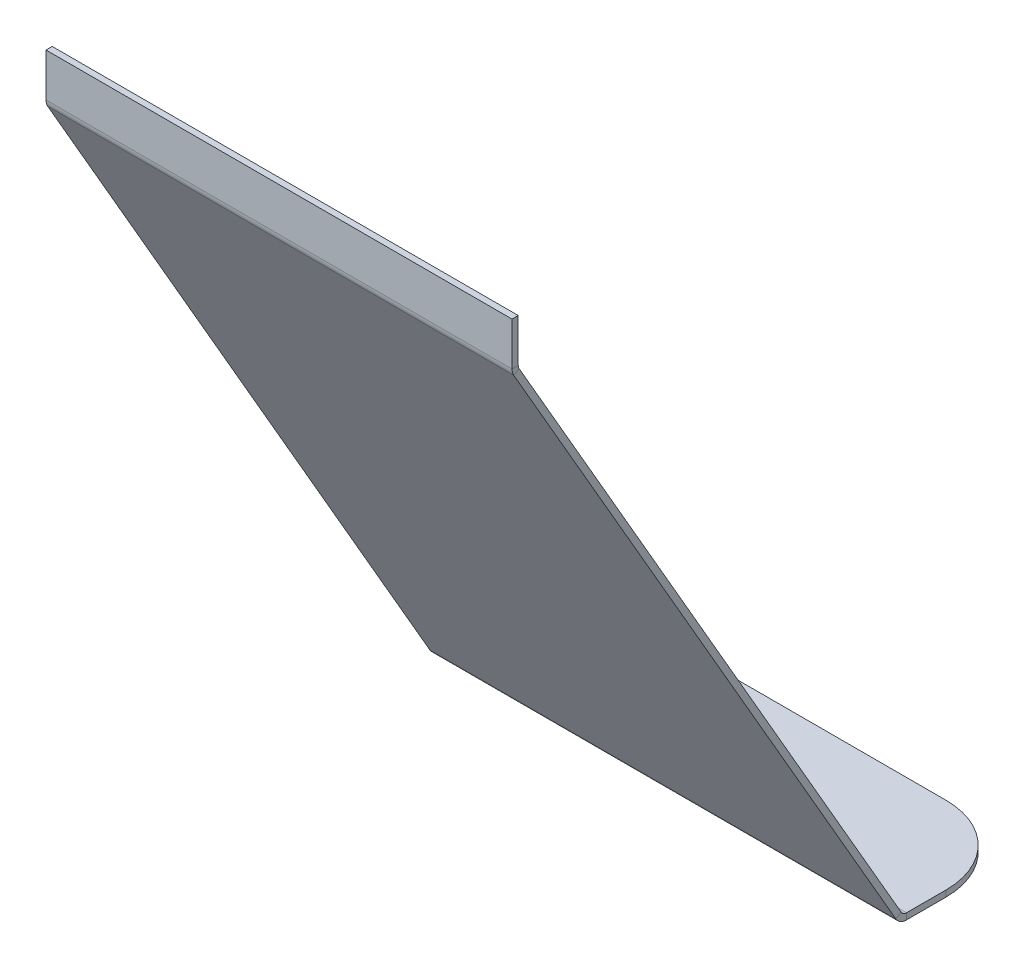
ISO-10303-21;
HEADER;
FILE_DESCRIPTION(('STEP AP214'),'2;1');
FILE_NAME('part.step','',(''),(''),'','','');
FILE_SCHEMA(('AUTOMOTIVE_DESIGN { 1 0 10303 214 1 1 1 1 }'));
ENDSEC;
DATA;
#1=APPLICATION_CONTEXT('core data for automotive mechanical design processes');
#2=APPLICATION_PROTOCOL_DEFINITION('international standard','automotive_design',2000,#1);
#3=PRODUCT_CONTEXT('',#1,'mechanical');
#4=PRODUCT('Part','Part','',(#3));
#5=PRODUCT_RELATED_PRODUCT_CATEGORY('part','',(#4));
#6=PRODUCT_DEFINITION_FORMATION('','',#4);
#7=PRODUCT_DEFINITION_CONTEXT('part definition',#1,'design');
#8=PRODUCT_DEFINITION('design','',#6,#7);
#9=PRODUCT_DEFINITION_SHAPE('','',#8);
#10=(LENGTH_UNIT() NAMED_UNIT(*) SI_UNIT(.MILLI.,.METRE.));
#11=(NAMED_UNIT(*) PLANE_ANGLE_UNIT() SI_UNIT($,.RADIAN.));
#12=(NAMED_UNIT(*) SI_UNIT($,.STERADIAN.) SOLID_ANGLE_UNIT());
#13=UNCERTAINTY_MEASURE_WITH_UNIT(LENGTH_MEASURE(1.E-05),#10,'distance_accuracy_value','');
#14=(GEOMETRIC_REPRESENTATION_CONTEXT(3) GLOBAL_UNCERTAINTY_ASSIGNED_CONTEXT((#13)) GLOBAL_UNIT_ASSIGNED_CONTEXT((#10,
#11,#12)) REPRESENTATION_CONTEXT('',''));
#15=CARTESIAN_POINT('',(0.,0.,0.));
#16=DIRECTION('',(0.,0.,1.));
#17=DIRECTION('',(1.,0.,0.));
#18=AXIS2_PLACEMENT_3D('',#15,#16,#17);
#19=CARTESIAN_POINT('',(30.,43.401,24.8266389254232));
#20=DIRECTION('',(0.,-0.500000000000001,0.866025403784438));
#21=DIRECTION('',(0.,-0.866025403784438,-0.500000000000001));
#22=AXIS2_PLACEMENT_3D('',#19,#20,#21);
#23=PLANE('',#22);
#24=DIRECTION('',(1.,0.,0.));
#25=VECTOR('',#24,1.);
#26=CARTESIAN_POINT('',(30.,43.3081796769724,24.773049086937));
#27=LINE('',#26,#25);
#28=CARTESIAN_POINT('',(30.,43.3081796769724,24.773049086937));
#29=VERTEX_POINT('',#28);
#30=CARTESIAN_POINT('',(0.,43.3081796769724,24.773049086937));
#31=VERTEX_POINT('',#30);
#32=EDGE_CURVE('E247',#29,#31,#27,.F.);
#33=ORIENTED_EDGE('',*,*,#32,.F.);
#34=DIRECTION('',(0.,0.866025403784438,0.500000000000001));
#35=VECTOR('',#34,1.);
#36=CARTESIAN_POINT('',(30.,43.401,24.8266389254232));
#37=LINE('',#36,#35);
#38=CARTESIAN_POINT('',(30.,0.699999999999992,0.173205080756899));
#39=VERTEX_POINT('',#38);
#40=EDGE_CURVE('E327',#39,#29,#37,.T.);
#41=ORIENTED_EDGE('',*,*,#40,.F.);
#42=DIRECTION('',(-1.,0.,0.));
#43=VECTOR('',#42,1.);
#44=CARTESIAN_POINT('',(0.,0.699999999999992,0.173205080756899));
#45=LINE('',#44,#43);
#46=CARTESIAN_POINT('',(0.,0.699999999999992,0.173205080756899));
#47=VERTEX_POINT('',#46);
#48=EDGE_CURVE('E309',#47,#39,#45,.F.);
#49=ORIENTED_EDGE('',*,*,#48,.F.);
#50=DIRECTION('',(0.,0.866025403784438,0.500000000000001));
#51=VECTOR('',#50,1.);
#52=CARTESIAN_POINT('',(0.,43.401,24.8266389254232));
#53=LINE('',#52,#51);
#54=EDGE_CURVE('E323',#47,#31,#53,.T.);
#55=ORIENTED_EDGE('',*,*,#54,.T.);
#56=EDGE_LOOP('',(#33,#41,#49,#55));
#57=FACE_BOUND('',#56,.T.);
#58=ADVANCED_FACE('F70',(#57),#23,.F.);
#59=CARTESIAN_POINT('',(30.,43.201,25.173049086937));
#60=DIRECTION('',(0.,-0.500000000000001,0.866025403784438));
#61=DIRECTION('',(0.,-0.866025403784438,-0.500000000000001));
#62=AXIS2_PLACEMENT_3D('',#59,#60,#61);
#63=PLANE('',#62);
#64=DIRECTION('',(0.,-0.866025403784438,-0.500000000000001));
#65=VECTOR('',#64,1.);
#66=CARTESIAN_POINT('',(30.,43.201,25.173049086937));
#67=LINE('',#66,#65);
#68=CARTESIAN_POINT('',(30.,0.49999999999998,0.519615242270663));
#69=VERTEX_POINT('',#68);
#70=CARTESIAN_POINT('',(30.,43.1081796769724,25.1194592484507));
#71=VERTEX_POINT('',#70);
#72=EDGE_CURVE('E328',#69,#71,#67,.F.);
#73=ORIENTED_EDGE('',*,*,#72,.T.);
#74=DIRECTION('',(1.,0.,0.));
#75=VECTOR('',#74,1.);
#76=CARTESIAN_POINT('',(30.,43.1081796769724,25.1194592484507));
#77=LINE('',#76,#75);
#78=CARTESIAN_POINT('',(0.,43.1081796769724,25.1194592484507));
#79=VERTEX_POINT('',#78);
#80=EDGE_CURVE('E180',#71,#79,#77,.F.);
#81=ORIENTED_EDGE('',*,*,#80,.T.);
#82=DIRECTION('',(0.,-0.866025403784438,-0.500000000000001));
#83=VECTOR('',#82,1.);
#84=CARTESIAN_POINT('',(0.,43.201,25.173049086937));
#85=LINE('',#84,#83);
#86=CARTESIAN_POINT('',(0.,0.499999999999992,0.519615242270674));
#87=VERTEX_POINT('',#86);
#88=EDGE_CURVE('E319',#87,#79,#85,.F.);
#89=ORIENTED_EDGE('',*,*,#88,.F.);
#90=DIRECTION('',(-1.,0.,0.));
#91=VECTOR('',#90,1.);
#92=CARTESIAN_POINT('',(0.,0.499999999999992,0.519615242270674));
#93=LINE('',#92,#91);
#94=EDGE_CURVE('E292',#87,#69,#93,.F.);
#95=ORIENTED_EDGE('',*,*,#94,.T.);
#96=EDGE_LOOP('',(#73,#81,#89,#95));
#97=FACE_BOUND('',#96,.T.);
#98=ADVANCED_FACE('F396',(#97),#63,.T.);
#99=CARTESIAN_POINT('',(30.,43.401,24.8266389254232));
#100=DIRECTION('',(1.,0.,0.));
#101=DIRECTION('',(0.,0.866025403784438,0.500000000000001));
#102=AXIS2_PLACEMENT_3D('',#99,#100,#101);
#103=PLANE('',#102);
#104=ORIENTED_EDGE('',*,*,#40,.T.);
#105=DIRECTION('',(0.,-0.499999999999997,0.866025403784441));
#106=VECTOR('',#105,1.);
#107=CARTESIAN_POINT('',(30.,43.3081796769724,24.773049086937));
#108=LINE('',#107,#106);
#109=EDGE_CURVE('E242',#29,#71,#108,.T.);
#110=ORIENTED_EDGE('',*,*,#109,.T.);
#111=ORIENTED_EDGE('',*,*,#72,.F.);
#112=DIRECTION('',(0.,-0.500000000000001,0.866025403784438));
#113=VECTOR('',#112,1.);
#114=CARTESIAN_POINT('',(30.,0.699999999999992,0.173205080756899));
#115=LINE('',#114,#113);
#116=EDGE_CURVE('E315',#39,#69,#115,.T.);
#117=ORIENTED_EDGE('',*,*,#116,.F.);
#118=EDGE_LOOP('',(#104,#110,#111,#117));
#119=FACE_BOUND('',#118,.T.);
#120=ADVANCED_FACE('F397',(#119),#103,.T.);
#121=CARTESIAN_POINT('',(0.,43.401,24.8266389254232));
#122=DIRECTION('',(1.,0.,0.));
#123=DIRECTION('',(0.,0.866025403784438,0.500000000000001));
#124=AXIS2_PLACEMENT_3D('',#121,#122,#123);
#125=PLANE('',#124);
#126=DIRECTION('',(0.,-0.499999999999997,0.866025403784441));
#127=VECTOR('',#126,1.);
#128=CARTESIAN_POINT('',(0.,43.3081796769724,24.773049086937));
#129=LINE('',#128,#127);
#130=EDGE_CURVE('E252',#31,#79,#129,.T.);
#131=ORIENTED_EDGE('',*,*,#130,.F.);
#132=ORIENTED_EDGE('',*,*,#54,.F.);
#133=DIRECTION('',(0.,-0.500000000000001,0.866025403784438));
#134=VECTOR('',#133,1.);
#135=CARTESIAN_POINT('',(0.,0.699999999999992,0.173205080756899));
#136=LINE('',#135,#134);
#137=EDGE_CURVE('E301',#47,#87,#136,.T.);
#138=ORIENTED_EDGE('',*,*,#137,.T.);
#139=ORIENTED_EDGE('',*,*,#88,.T.);
#140=EDGE_LOOP('',(#131,#132,#138,#139));
#141=FACE_BOUND('',#140,.T.);
#142=ADVANCED_FACE('F408',(#141),#125,.F.);
#143=CARTESIAN_POINT('',(30.,0.899999999999992,-0.173205080756877));
#144=DIRECTION('',(1.,0.,0.));
#145=DIRECTION('',(0.,0.,-1.));
#146=AXIS2_PLACEMENT_3D('',#143,#144,#145);
#147=PLANE('',#146);
#148=DIRECTION('',(0.,1.,0.));
#149=VECTOR('',#148,1.);
#150=CARTESIAN_POINT('',(30.,0.0999999999999924,-0.173205080756874));
#151=LINE('',#150,#149);
#152=CARTESIAN_POINT('',(30.,0.499999999999992,-0.173205080756875));
#153=VERTEX_POINT('',#152);
#154=CARTESIAN_POINT('',(30.,0.0999999999999925,-0.173205080756874));
#155=VERTEX_POINT('',#154);
#156=EDGE_CURVE('E256',#153,#155,#151,.F.);
#157=ORIENTED_EDGE('',*,*,#156,.F.);
#158=CARTESIAN_POINT('',(30.,0.899999999999992,-0.173205080756877));
#159=DIRECTION('',(-1.,0.,0.));
#160=DIRECTION('',(0.,0.,1.));
#161=AXIS2_PLACEMENT_3D('',#158,#159,#160);
#162=CIRCLE('',#161,0.4);
#163=EDGE_CURVE('E305',#39,#153,#162,.F.);
#164=ORIENTED_EDGE('',*,*,#163,.F.);
#165=ORIENTED_EDGE('',*,*,#116,.T.);
#166=CARTESIAN_POINT('',(30.,0.899999999999992,-0.173205080756877));
#167=DIRECTION('',(-1.,0.,0.));
#168=DIRECTION('',(0.,0.,1.));
#169=AXIS2_PLACEMENT_3D('',#166,#167,#168);
#170=CIRCLE('',#169,0.8);
#171=EDGE_CURVE('E296',#69,#155,#170,.F.);
#172=ORIENTED_EDGE('',*,*,#171,.T.);
#173=EDGE_LOOP('',(#157,#164,#165,#172));
#174=FACE_BOUND('',#173,.T.);
#175=ADVANCED_FACE('F388',(#174),#147,.T.);
#176=CARTESIAN_POINT('',(0.,0.899999999999992,-0.173205080756877));
#177=DIRECTION('',(1.,0.,0.));
#178=DIRECTION('',(0.,0.,-1.));
#179=AXIS2_PLACEMENT_3D('',#176,#177,#178);
#180=PLANE('',#179);
#181=CARTESIAN_POINT('',(0.,0.899999999999992,-0.173205080756877));
#182=DIRECTION('',(-1.,0.,0.));
#183=DIRECTION('',(0.,0.,1.));
#184=AXIS2_PLACEMENT_3D('',#181,#182,#183);
#185=CIRCLE('',#184,0.4);
#186=CARTESIAN_POINT('',(0.,0.499999999999992,-0.173205080756875));
#187=VERTEX_POINT('',#186);
#188=EDGE_CURVE('E262',#187,#47,#185,.T.);
#189=ORIENTED_EDGE('',*,*,#188,.F.);
#190=DIRECTION('',(0.,1.,0.));
#191=VECTOR('',#190,1.);
#192=CARTESIAN_POINT('',(0.,0.499999999999992,-0.173205080756875));
#193=LINE('',#192,#191);
#194=CARTESIAN_POINT('',(0.,0.0999999999999924,-0.173205080756873));
#195=VERTEX_POINT('',#194);
#196=EDGE_CURVE('E282',#187,#195,#193,.F.);
#197=ORIENTED_EDGE('',*,*,#196,.T.);
#198=CARTESIAN_POINT('',(0.,0.899999999999992,-0.173205080756877));
#199=DIRECTION('',(-1.,0.,0.));
#200=DIRECTION('',(0.,0.,1.));
#201=AXIS2_PLACEMENT_3D('',#198,#199,#200);
#202=CIRCLE('',#201,0.8);
#203=EDGE_CURVE('E297',#195,#87,#202,.T.);
#204=ORIENTED_EDGE('',*,*,#203,.T.);
#205=ORIENTED_EDGE('',*,*,#137,.F.);
#206=EDGE_LOOP('',(#189,#197,#204,#205));
#207=FACE_BOUND('',#206,.T.);
#208=ADVANCED_FACE('F384',(#207),#180,.F.);
#209=CARTESIAN_POINT('',(0.,0.899999999999992,-0.173205080756877));
#210=DIRECTION('',(-1.,0.,0.));
#211=DIRECTION('',(0.,-1.,0.));
#212=AXIS2_PLACEMENT_3D('',#209,#210,#211);
#213=CYLINDRICAL_SURFACE('',#212,0.8);
#214=ORIENTED_EDGE('',*,*,#94,.F.);
#215=ORIENTED_EDGE('',*,*,#203,.F.);
#216=DIRECTION('',(-1.,0.,0.));
#217=VECTOR('',#216,1.);
#218=CARTESIAN_POINT('',(30.,0.0999999999999924,-0.173205080756874));
#219=LINE('',#218,#217);
#220=EDGE_CURVE('E278',#195,#155,#219,.F.);
#221=ORIENTED_EDGE('',*,*,#220,.T.);
#222=ORIENTED_EDGE('',*,*,#171,.F.);
#223=EDGE_LOOP('',(#214,#215,#221,#222));
#224=FACE_BOUND('',#223,.T.);
#225=ADVANCED_FACE('F386',(#224),#213,.T.);
#226=CARTESIAN_POINT('',(0.,0.899999999999992,-0.173205080756877));
#227=DIRECTION('',(-1.,0.,0.));
#228=DIRECTION('',(0.,-1.,0.));
#229=AXIS2_PLACEMENT_3D('',#226,#227,#228);
#230=CYLINDRICAL_SURFACE('',#229,0.4);
#231=ORIENTED_EDGE('',*,*,#48,.T.);
#232=ORIENTED_EDGE('',*,*,#163,.T.);
#233=DIRECTION('',(-1.,0.,0.));
#234=VECTOR('',#233,1.);
#235=CARTESIAN_POINT('',(30.,0.499999999999992,-0.173205080756876));
#236=LINE('',#235,#234);
#237=EDGE_CURVE('E286',#153,#187,#236,.T.);
#238=ORIENTED_EDGE('',*,*,#237,.T.);
#239=ORIENTED_EDGE('',*,*,#188,.T.);
#240=EDGE_LOOP('',(#231,#232,#238,#239));
#241=FACE_BOUND('',#240,.T.);
#242=ADVANCED_FACE('F611',(#241),#230,.F.);
#243=CARTESIAN_POINT('',(30.,0.0999999999999932,0.057735026918975));
#244=DIRECTION('',(-1.,0.,0.));
#245=DIRECTION('',(0.,0.,1.));
#246=AXIS2_PLACEMENT_3D('',#243,#244,#245);
#247=PLANE('',#246);
#248=DIRECTION('',(0.,0.,1.));
#249=VECTOR('',#248,1.);
#250=CARTESIAN_POINT('',(30.,0.0999999999999938,0.230940107675853));
#251=LINE('',#250,#249);
#252=CARTESIAN_POINT('',(30.,0.0999999999999837,-2.71132486540518));
#253=VERTEX_POINT('',#252);
#254=EDGE_CURVE('E266',#253,#155,#251,.T.);
#255=ORIENTED_EDGE('',*,*,#254,.F.);
#256=DIRECTION('',(0.,1.,0.));
#257=VECTOR('',#256,1.);
#258=CARTESIAN_POINT('',(30.,0.0999999999999837,-2.71132486540518));
#259=LINE('',#258,#257);
#260=CARTESIAN_POINT('',(30.,0.499999999999984,-2.71132486540518));
#261=VERTEX_POINT('',#260);
#262=EDGE_CURVE('E332',#253,#261,#259,.T.);
#263=ORIENTED_EDGE('',*,*,#262,.T.);
#264=DIRECTION('',(0.,0.,-1.));
#265=VECTOR('',#264,1.);
#266=CARTESIAN_POINT('',(30.,0.499999999999993,0.0577350269189736));
#267=LINE('',#266,#265);
#268=EDGE_CURVE('E275',#261,#153,#267,.F.);
#269=ORIENTED_EDGE('',*,*,#268,.T.);
#270=ORIENTED_EDGE('',*,*,#156,.T.);
#271=EDGE_LOOP('',(#255,#263,#269,#270));
#272=FACE_BOUND('',#271,.T.);
#273=ADVANCED_FACE('F367',(#272),#247,.F.);
#274=CARTESIAN_POINT('',(0.,0.0999999999999665,-7.71132486540518));
#275=DIRECTION('',(1.,0.,0.));
#276=DIRECTION('',(0.,0.,-1.));
#277=AXIS2_PLACEMENT_3D('',#274,#275,#276);
#278=PLANE('',#277);
#279=DIRECTION('',(0.,0.,1.));
#280=VECTOR('',#279,1.);
#281=CARTESIAN_POINT('',(0.,0.499999999999967,-7.71132486540518));
#282=LINE('',#281,#280);
#283=CARTESIAN_POINT('',(0.,0.499999999999984,-2.71132486540518));
#284=VERTEX_POINT('',#283);
#285=EDGE_CURVE('E272',#187,#284,#282,.F.);
#286=ORIENTED_EDGE('',*,*,#285,.T.);
#287=DIRECTION('',(0.,1.,0.));
#288=VECTOR('',#287,1.);
#289=CARTESIAN_POINT('',(0.,0.0999999999999837,-2.71132486540518));
#290=LINE('',#289,#288);
#291=CARTESIAN_POINT('',(0.,0.0999999999999837,-2.71132486540518));
#292=VERTEX_POINT('',#291);
#293=EDGE_CURVE('E13',#284,#292,#290,.F.);
#294=ORIENTED_EDGE('',*,*,#293,.T.);
#295=DIRECTION('',(0.,0.,-1.));
#296=VECTOR('',#295,1.);
#297=CARTESIAN_POINT('',(0.,0.0999999999999938,0.230940107675853));
#298=LINE('',#297,#296);
#299=EDGE_CURVE('E263',#195,#292,#298,.T.);
#300=ORIENTED_EDGE('',*,*,#299,.F.);
#301=ORIENTED_EDGE('',*,*,#196,.F.);
#302=EDGE_LOOP('',(#286,#294,#300,#301));
#303=FACE_BOUND('',#302,.T.);
#304=ADVANCED_FACE('F381',(#303),#278,.F.);
#305=CARTESIAN_POINT('',(0.,0.0999999999999938,0.230940107675853));
#306=DIRECTION('',(0.,1.,0.));
#307=DIRECTION('',(0.,0.,1.));
#308=AXIS2_PLACEMENT_3D('',#305,#306,#307);
#309=PLANE('',#308);
#310=CARTESIAN_POINT('',(15.,0.0999999999998657,-4.05773502691895));
#311=DIRECTION('',(0.,1.,0.));
#312=DIRECTION('',(0.,0.,1.));
#313=AXIS2_PLACEMENT_3D('',#310,#311,#312);
#314=CIRCLE('',#313,1.55);
#315=CARTESIAN_POINT('',(15.,0.0999999999998711,-2.50773502691896));
#316=VERTEX_POINT('',#315);
#317=EDGE_CURVE('E672',#316,#316,#314,.T.);
#318=ORIENTED_EDGE('',*,*,#317,.T.);
#319=EDGE_LOOP('',(#318));
#320=FACE_BOUND('',#319,.T.);
#321=DIRECTION('',(1.,0.,0.));
#322=VECTOR('',#321,1.);
#323=CARTESIAN_POINT('',(0.,0.0999999999999665,-7.71132486540518));
#324=LINE('',#323,#322);
#325=CARTESIAN_POINT('',(5.,0.0999999999999665,-7.71132486540518));
#326=VERTEX_POINT('',#325);
#327=CARTESIAN_POINT('',(25.,0.0999999999999665,-7.71132486540518));
#328=VERTEX_POINT('',#327);
#329=EDGE_CURVE('E259',#326,#328,#324,.T.);
#330=ORIENTED_EDGE('',*,*,#329,.T.);
#331=CARTESIAN_POINT('',(25.,0.0999999999999837,-2.71132486540518));
#332=DIRECTION('',(0.,1.,0.));
#333=DIRECTION('',(0.,0.,1.));
#334=AXIS2_PLACEMENT_3D('',#331,#332,#333);
#335=CIRCLE('',#334,5.);
#336=EDGE_CURVE('E79',#328,#253,#335,.F.);
#337=ORIENTED_EDGE('',*,*,#336,.T.);
#338=ORIENTED_EDGE('',*,*,#254,.T.);
#339=ORIENTED_EDGE('',*,*,#220,.F.);
#340=ORIENTED_EDGE('',*,*,#299,.T.);
#341=CARTESIAN_POINT('',(5.,0.0999999999999837,-2.71132486540518));
#342=DIRECTION('',(0.,1.,0.));
#343=DIRECTION('',(0.,0.,1.));
#344=AXIS2_PLACEMENT_3D('',#341,#342,#343);
#345=CIRCLE('',#344,5.);
#346=EDGE_CURVE('E354',#292,#326,#345,.F.);
#347=ORIENTED_EDGE('',*,*,#346,.T.);
#348=EDGE_LOOP('',(#330,#337,#338,#339,#340,#347));
#349=FACE_BOUND('',#348,.T.);
#350=ADVANCED_FACE('F362',(#320,#349),#309,.F.);
#351=CARTESIAN_POINT('',(0.,0.499999999999994,0.230940107675851));
#352=DIRECTION('',(0.,1.,0.));
#353=DIRECTION('',(0.,0.,1.));
#354=AXIS2_PLACEMENT_3D('',#351,#352,#353);
#355=PLANE('',#354);
#356=CARTESIAN_POINT('',(15.,0.499999999999979,-4.05773502691896));
#357=DIRECTION('',(0.,1.,0.));
#358=DIRECTION('',(0.,0.,1.));
#359=AXIS2_PLACEMENT_3D('',#356,#357,#358);
#360=CIRCLE('',#359,1.55);
#361=CARTESIAN_POINT('',(15.,0.499999999999984,-2.50773502691896));
#362=VERTEX_POINT('',#361);
#363=EDGE_CURVE('E674',#362,#362,#360,.T.);
#364=ORIENTED_EDGE('',*,*,#363,.F.);
#365=EDGE_LOOP('',(#364));
#366=FACE_BOUND('',#365,.T.);
#367=ORIENTED_EDGE('',*,*,#268,.F.);
#368=CARTESIAN_POINT('',(25.,0.499999999999984,-2.71132486540518));
#369=DIRECTION('',(0.,1.,0.));
#370=DIRECTION('',(0.,0.,1.));
#371=AXIS2_PLACEMENT_3D('',#368,#369,#370);
#372=CIRCLE('',#371,5.);
#373=CARTESIAN_POINT('',(25.,0.499999999999967,-7.71132486540518));
#374=VERTEX_POINT('',#373);
#375=EDGE_CURVE('E345',#261,#374,#372,.T.);
#376=ORIENTED_EDGE('',*,*,#375,.T.);
#377=DIRECTION('',(-1.,0.,0.));
#378=VECTOR('',#377,1.);
#379=CARTESIAN_POINT('',(30.,0.499999999999967,-7.71132486540518));
#380=LINE('',#379,#378);
#381=CARTESIAN_POINT('',(5.,0.499999999999967,-7.71132486540518));
#382=VERTEX_POINT('',#381);
#383=EDGE_CURVE('E269',#382,#374,#380,.F.);
#384=ORIENTED_EDGE('',*,*,#383,.F.);
#385=CARTESIAN_POINT('',(5.,0.499999999999984,-2.71132486540518));
#386=DIRECTION('',(0.,1.,0.));
#387=DIRECTION('',(0.,0.,1.));
#388=AXIS2_PLACEMENT_3D('',#385,#386,#387);
#389=CIRCLE('',#388,5.);
#390=EDGE_CURVE('E342',#382,#284,#389,.T.);
#391=ORIENTED_EDGE('',*,*,#390,.T.);
#392=ORIENTED_EDGE('',*,*,#285,.F.);
#393=ORIENTED_EDGE('',*,*,#237,.F.);
#394=EDGE_LOOP('',(#367,#376,#384,#391,#392,#393));
#395=FACE_BOUND('',#394,.T.);
#396=ADVANCED_FACE('F373',(#366,#395),#355,.T.);
#397=CARTESIAN_POINT('',(30.,0.0999999999999665,-7.71132486540518));
#398=DIRECTION('',(0.,0.,1.));
#399=DIRECTION('',(0.,-1.,0.));
#400=AXIS2_PLACEMENT_3D('',#397,#398,#399);
#401=PLANE('',#400);
#402=ORIENTED_EDGE('',*,*,#383,.T.);
#403=DIRECTION('',(0.,1.,0.));
#404=VECTOR('',#403,1.);
#405=CARTESIAN_POINT('',(25.,0.0999999999999665,-7.71132486540518));
#406=LINE('',#405,#404);
#407=EDGE_CURVE('E92',#374,#328,#406,.F.);
#408=ORIENTED_EDGE('',*,*,#407,.T.);
#409=ORIENTED_EDGE('',*,*,#329,.F.);
#410=DIRECTION('',(0.,1.,0.));
#411=VECTOR('',#410,1.);
#412=CARTESIAN_POINT('',(5.,0.0999999999999665,-7.71132486540518));
#413=LINE('',#412,#411);
#414=EDGE_CURVE('E348',#326,#382,#413,.T.);
#415=ORIENTED_EDGE('',*,*,#414,.T.);
#416=EDGE_LOOP('',(#402,#408,#409,#415));
#417=FACE_BOUND('',#416,.T.);
#418=ADVANCED_FACE('F375',(#417),#401,.F.);
#419=CARTESIAN_POINT('',(0.,43.5081796769724,24.4266389254232));
#420=DIRECTION('',(-1.,0.,0.));
#421=DIRECTION('',(0.,0.,1.));
#422=AXIS2_PLACEMENT_3D('',#419,#420,#421);
#423=PLANE('',#422);
#424=DIRECTION('',(0.,0.,1.));
#425=VECTOR('',#424,1.);
#426=CARTESIAN_POINT('',(0.,43.5081796769724,24.8266389254232));
#427=LINE('',#426,#425);
#428=CARTESIAN_POINT('',(0.,43.5081796769724,24.8266389254232));
#429=VERTEX_POINT('',#428);
#430=CARTESIAN_POINT('',(0.,43.5081796769724,25.2266389254232));
#431=VERTEX_POINT('',#430);
#432=EDGE_CURVE('E412',#429,#431,#427,.T.);
#433=ORIENTED_EDGE('',*,*,#432,.F.);
#434=CARTESIAN_POINT('',(0.,43.5081796769724,24.4266389254232));
#435=DIRECTION('',(1.,0.,0.));
#436=DIRECTION('',(0.,0.,-1.));
#437=AXIS2_PLACEMENT_3D('',#434,#435,#436);
#438=CIRCLE('',#437,0.400000000000001);
#439=EDGE_CURVE('E184',#31,#429,#438,.F.);
#440=ORIENTED_EDGE('',*,*,#439,.F.);
#441=ORIENTED_EDGE('',*,*,#130,.T.);
#442=CARTESIAN_POINT('',(0.,43.5081796769724,24.4266389254232));
#443=DIRECTION('',(1.,0.,0.));
#444=DIRECTION('',(0.,0.,-1.));
#445=AXIS2_PLACEMENT_3D('',#442,#443,#444);
#446=CIRCLE('',#445,0.800000000000001);
#447=EDGE_CURVE('E240',#79,#431,#446,.F.);
#448=ORIENTED_EDGE('',*,*,#447,.T.);
#449=EDGE_LOOP('',(#433,#440,#441,#448));
#450=FACE_BOUND('',#449,.T.);
#451=ADVANCED_FACE('F410',(#450),#423,.T.);
#452=CARTESIAN_POINT('',(30.,43.5081796769724,24.4266389254232));
#453=DIRECTION('',(-1.,0.,0.));
#454=DIRECTION('',(0.,0.,1.));
#455=AXIS2_PLACEMENT_3D('',#452,#453,#454);
#456=PLANE('',#455);
#457=CARTESIAN_POINT('',(30.,43.5081796769724,24.4266389254232));
#458=DIRECTION('',(1.,0.,0.));
#459=DIRECTION('',(0.,0.,-1.));
#460=AXIS2_PLACEMENT_3D('',#457,#458,#459);
#461=CIRCLE('',#460,0.400000000000001);
#462=CARTESIAN_POINT('',(30.,43.5081796769724,24.8266389254232));
#463=VERTEX_POINT('',#462);
#464=EDGE_CURVE('E191',#463,#29,#461,.T.);
#465=ORIENTED_EDGE('',*,*,#464,.F.);
#466=DIRECTION('',(0.,0.,1.));
#467=VECTOR('',#466,1.);
#468=CARTESIAN_POINT('',(30.,43.5081796769724,24.8266389254232));
#469=LINE('',#468,#467);
#470=CARTESIAN_POINT('',(30.,43.5081796769724,25.2266389254232));
#471=VERTEX_POINT('',#470);
#472=EDGE_CURVE('E188',#463,#471,#469,.T.);
#473=ORIENTED_EDGE('',*,*,#472,.T.);
#474=CARTESIAN_POINT('',(30.,43.5081796769724,24.4266389254232));
#475=DIRECTION('',(1.,0.,0.));
#476=DIRECTION('',(0.,0.,-1.));
#477=AXIS2_PLACEMENT_3D('',#474,#475,#476);
#478=CIRCLE('',#477,0.800000000000001);
#479=EDGE_CURVE('E173',#471,#71,#478,.T.);
#480=ORIENTED_EDGE('',*,*,#479,.T.);
#481=ORIENTED_EDGE('',*,*,#109,.F.);
#482=EDGE_LOOP('',(#465,#473,#480,#481));
#483=FACE_BOUND('',#482,.T.);
#484=ADVANCED_FACE('F189',(#483),#456,.F.);
#485=CARTESIAN_POINT('',(30.,43.5081796769724,24.4266389254232));
#486=DIRECTION('',(1.,0.,0.));
#487=DIRECTION('',(0.,0.,1.));
#488=AXIS2_PLACEMENT_3D('',#485,#486,#487);
#489=CYLINDRICAL_SURFACE('',#488,0.800000000000001);
#490=ORIENTED_EDGE('',*,*,#80,.F.);
#491=ORIENTED_EDGE('',*,*,#479,.F.);
#492=DIRECTION('',(-1.,0.,0.));
#493=VECTOR('',#492,1.);
#494=CARTESIAN_POINT('',(0.,43.5081796769724,25.2266389254232));
#495=LINE('',#494,#493);
#496=EDGE_CURVE('E177',#471,#431,#495,.T.);
#497=ORIENTED_EDGE('',*,*,#496,.T.);
#498=ORIENTED_EDGE('',*,*,#447,.F.);
#499=EDGE_LOOP('',(#490,#491,#497,#498));
#500=FACE_BOUND('',#499,.T.);
#501=ADVANCED_FACE('F175',(#500),#489,.T.);
#502=CARTESIAN_POINT('',(30.,43.5081796769724,24.4266389254232));
#503=DIRECTION('',(1.,0.,0.));
#504=DIRECTION('',(0.,0.,1.));
#505=AXIS2_PLACEMENT_3D('',#502,#503,#504);
#506=CYLINDRICAL_SURFACE('',#505,0.400000000000001);
#507=ORIENTED_EDGE('',*,*,#32,.T.);
#508=ORIENTED_EDGE('',*,*,#439,.T.);
#509=DIRECTION('',(1.,0.,0.));
#510=VECTOR('',#509,1.);
#511=CARTESIAN_POINT('',(0.,43.5081796769724,24.8266389254232));
#512=LINE('',#511,#510);
#513=EDGE_CURVE('E196',#429,#463,#512,.T.);
#514=ORIENTED_EDGE('',*,*,#513,.T.);
#515=ORIENTED_EDGE('',*,*,#464,.T.);
#516=EDGE_LOOP('',(#507,#508,#514,#515));
#517=FACE_BOUND('',#516,.T.);
#518=ADVANCED_FACE('F400',(#517),#506,.F.);
#519=CARTESIAN_POINT('',(30.,46.2938203230276,25.2266389254232));
#520=DIRECTION('',(-1.,0.,0.));
#521=DIRECTION('',(0.,0.,1.));
#522=AXIS2_PLACEMENT_3D('',#519,#520,#521);
#523=PLANE('',#522);
#524=ORIENTED_EDGE('',*,*,#472,.F.);
#525=DIRECTION('',(0.,1.,0.));
#526=VECTOR('',#525,1.);
#527=CARTESIAN_POINT('',(30.,46.2938203230276,24.8266389254232));
#528=LINE('',#527,#526);
#529=CARTESIAN_POINT('',(30.,46.2938203230276,24.8266389254232));
#530=VERTEX_POINT('',#529);
#531=EDGE_CURVE('E206',#463,#530,#528,.T.);
#532=ORIENTED_EDGE('',*,*,#531,.T.);
#533=DIRECTION('',(0.,0.,-1.));
#534=VECTOR('',#533,1.);
#535=CARTESIAN_POINT('',(30.,46.2938203230276,25.2266389254232));
#536=LINE('',#535,#534);
#537=CARTESIAN_POINT('',(30.,46.2938203230276,25.2266389254232));
#538=VERTEX_POINT('',#537);
#539=EDGE_CURVE('E211',#538,#530,#536,.T.);
#540=ORIENTED_EDGE('',*,*,#539,.F.);
#541=DIRECTION('',(0.,1.,0.));
#542=VECTOR('',#541,1.);
#543=CARTESIAN_POINT('',(30.,46.2938203230276,25.2266389254232));
#544=LINE('',#543,#542);
#545=EDGE_CURVE('E201',#471,#538,#544,.T.);
#546=ORIENTED_EDGE('',*,*,#545,.F.);
#547=EDGE_LOOP('',(#524,#532,#540,#546));
#548=FACE_BOUND('',#547,.T.);
#549=ADVANCED_FACE('F209',(#548),#523,.F.);
#550=CARTESIAN_POINT('',(0.,43.401,25.2266389254232));
#551=DIRECTION('',(1.,0.,0.));
#552=DIRECTION('',(0.,0.,-1.));
#553=AXIS2_PLACEMENT_3D('',#550,#551,#552);
#554=PLANE('',#553);
#555=ORIENTED_EDGE('',*,*,#432,.T.);
#556=DIRECTION('',(0.,-1.,0.));
#557=VECTOR('',#556,1.);
#558=CARTESIAN_POINT('',(0.,43.401,25.2266389254232));
#559=LINE('',#558,#557);
#560=CARTESIAN_POINT('',(0.,46.2938203230276,25.2266389254232));
#561=VERTEX_POINT('',#560);
#562=EDGE_CURVE('E204',#561,#431,#559,.T.);
#563=ORIENTED_EDGE('',*,*,#562,.F.);
#564=DIRECTION('',(0.,0.,-1.));
#565=VECTOR('',#564,1.);
#566=CARTESIAN_POINT('',(0.,46.2938203230276,25.2266389254232));
#567=LINE('',#566,#565);
#568=CARTESIAN_POINT('',(0.,46.2938203230276,24.8266389254232));
#569=VERTEX_POINT('',#568);
#570=EDGE_CURVE('E228',#561,#569,#567,.T.);
#571=ORIENTED_EDGE('',*,*,#570,.T.);
#572=DIRECTION('',(0.,-1.,0.));
#573=VECTOR('',#572,1.);
#574=CARTESIAN_POINT('',(0.,43.401,24.8266389254232));
#575=LINE('',#574,#573);
#576=EDGE_CURVE('E214',#569,#429,#575,.T.);
#577=ORIENTED_EDGE('',*,*,#576,.T.);
#578=EDGE_LOOP('',(#555,#563,#571,#577));
#579=FACE_BOUND('',#578,.T.);
#580=ADVANCED_FACE('F420',(#579),#554,.F.);
#581=CARTESIAN_POINT('',(0.,0.,25.2266389254232));
#582=DIRECTION('',(0.,0.,-1.));
#583=DIRECTION('',(-1.,0.,0.));
#584=AXIS2_PLACEMENT_3D('',#581,#582,#583);
#585=PLANE('',#584);
#586=ORIENTED_EDGE('',*,*,#496,.F.);
#587=ORIENTED_EDGE('',*,*,#545,.T.);
#588=DIRECTION('',(-1.,0.,0.));
#589=VECTOR('',#588,1.);
#590=CARTESIAN_POINT('',(0.,46.2938203230276,25.2266389254232));
#591=LINE('',#590,#589);
#592=EDGE_CURVE('E213',#538,#561,#591,.T.);
#593=ORIENTED_EDGE('',*,*,#592,.T.);
#594=ORIENTED_EDGE('',*,*,#562,.T.);
#595=EDGE_LOOP('',(#586,#587,#593,#594));
#596=FACE_BOUND('',#595,.T.);
#597=ADVANCED_FACE('F200',(#596),#585,.F.);
#598=CARTESIAN_POINT('',(0.,0.,24.8266389254232));
#599=DIRECTION('',(0.,0.,-1.));
#600=DIRECTION('',(-1.,0.,0.));
#601=AXIS2_PLACEMENT_3D('',#598,#599,#600);
#602=PLANE('',#601);
#603=ORIENTED_EDGE('',*,*,#531,.F.);
#604=ORIENTED_EDGE('',*,*,#513,.F.);
#605=ORIENTED_EDGE('',*,*,#576,.F.);
#606=DIRECTION('',(-1.,0.,0.));
#607=VECTOR('',#606,1.);
#608=CARTESIAN_POINT('',(0.,46.2938203230276,24.8266389254232));
#609=LINE('',#608,#607);
#610=EDGE_CURVE('E222',#530,#569,#609,.T.);
#611=ORIENTED_EDGE('',*,*,#610,.F.);
#612=EDGE_LOOP('',(#603,#604,#605,#611));
#613=FACE_BOUND('',#612,.T.);
#614=ADVANCED_FACE('F415',(#613),#602,.T.);
#615=CARTESIAN_POINT('',(0.,46.2938203230276,25.2266389254232));
#616=DIRECTION('',(0.,-1.,0.));
#617=DIRECTION('',(0.,0.,-1.));
#618=AXIS2_PLACEMENT_3D('',#615,#616,#617);
#619=PLANE('',#618);
#620=ORIENTED_EDGE('',*,*,#610,.T.);
#621=ORIENTED_EDGE('',*,*,#570,.F.);
#622=ORIENTED_EDGE('',*,*,#592,.F.);
#623=ORIENTED_EDGE('',*,*,#539,.T.);
#624=EDGE_LOOP('',(#620,#621,#622,#623));
#625=FACE_BOUND('',#624,.T.);
#626=ADVANCED_FACE('F423',(#625),#619,.F.);
#627=CARTESIAN_POINT('',(15.,0.0999999999998657,-4.05773502691895));
#628=DIRECTION('',(0.,1.,0.));
#629=DIRECTION('',(0.,0.,1.));
#630=AXIS2_PLACEMENT_3D('',#627,#628,#629);
#631=CYLINDRICAL_SURFACE('',#630,1.55);
#632=ORIENTED_EDGE('',*,*,#317,.F.);
#633=EDGE_LOOP('',(#632));
#634=FACE_BOUND('',#633,.T.);
#635=ORIENTED_EDGE('',*,*,#363,.T.);
#636=EDGE_LOOP('',(#635));
#637=FACE_BOUND('',#636,.T.);
#638=ADVANCED_FACE('F425',(#634,#637),#631,.F.);
#639=CARTESIAN_POINT('',(25.,0.0999999999999837,-2.71132486540518));
#640=DIRECTION('',(0.,1.,0.));
#641=DIRECTION('',(0.,0.,1.));
#642=AXIS2_PLACEMENT_3D('',#639,#640,#641);
#643=CYLINDRICAL_SURFACE('',#642,5.);
#644=ORIENTED_EDGE('',*,*,#336,.F.);
#645=ORIENTED_EDGE('',*,*,#407,.F.);
#646=ORIENTED_EDGE('',*,*,#375,.F.);
#647=ORIENTED_EDGE('',*,*,#262,.F.);
#648=EDGE_LOOP('',(#644,#645,#646,#647));
#649=FACE_BOUND('',#648,.T.);
#650=ADVANCED_FACE('F370',(#649),#643,.T.);
#651=CARTESIAN_POINT('',(5.,0.0999999999999837,-2.71132486540518));
#652=DIRECTION('',(0.,1.,0.));
#653=DIRECTION('',(0.,0.,1.));
#654=AXIS2_PLACEMENT_3D('',#651,#652,#653);
#655=CYLINDRICAL_SURFACE('',#654,5.);
#656=ORIENTED_EDGE('',*,*,#346,.F.);
#657=ORIENTED_EDGE('',*,*,#293,.F.);
#658=ORIENTED_EDGE('',*,*,#390,.F.);
#659=ORIENTED_EDGE('',*,*,#414,.F.);
#660=EDGE_LOOP('',(#656,#657,#658,#659));
#661=FACE_BOUND('',#660,.T.);
#662=ADVANCED_FACE('F72',(#661),#655,.T.);
#663=CLOSED_SHELL('',(#58,#98,#120,#142,#175,#208,#225,#242,#273,#304,#350,#396,#418,#451,#484,
#501,#518,#549,#580,#597,#614,#626,#638,#650,#662));
#664=MANIFOLD_SOLID_BREP('B2',#663);
#665=ADVANCED_BREP_SHAPE_REPRESENTATION('',(#18,#664),#14);
#666=SHAPE_DEFINITION_REPRESENTATION(#9,#665);
ENDSEC;
END-ISO-10303-21;
